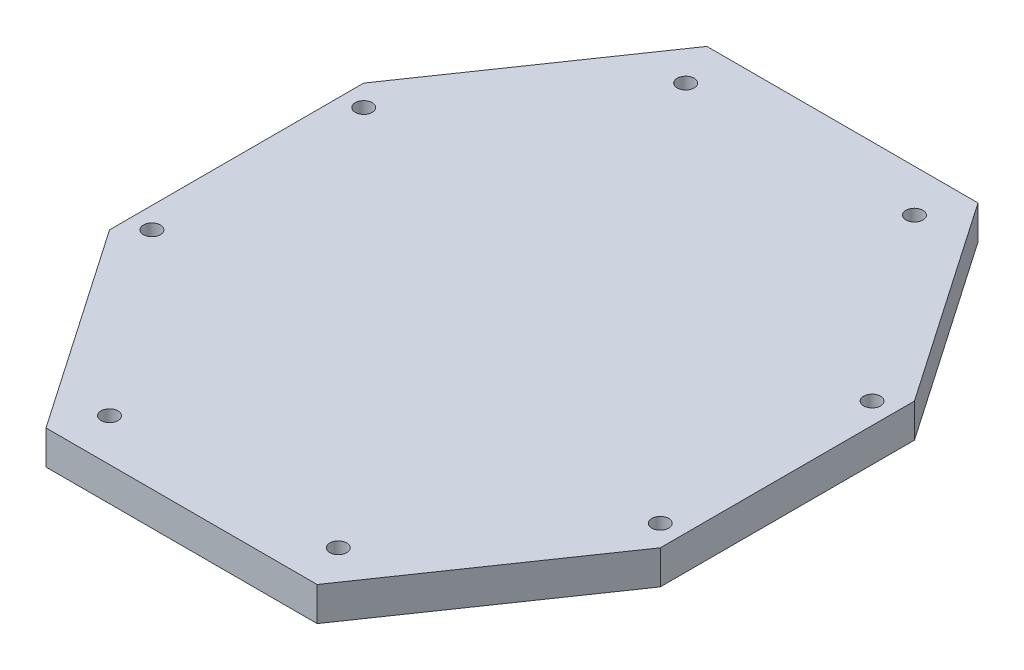
ISO-10303-21;
HEADER;
FILE_DESCRIPTION(('STEP AP214'),'2;1');
FILE_NAME('part.step','',(''),(''),'','','');
FILE_SCHEMA(('AUTOMOTIVE_DESIGN { 1 0 10303 214 1 1 1 1 }'));
ENDSEC;
DATA;
#1=APPLICATION_CONTEXT('core data for automotive mechanical design processes');
#2=APPLICATION_PROTOCOL_DEFINITION('international standard','automotive_design',2000,#1);
#3=PRODUCT_CONTEXT('',#1,'mechanical');
#4=PRODUCT('Part','Part','',(#3));
#5=PRODUCT_RELATED_PRODUCT_CATEGORY('part','',(#4));
#6=PRODUCT_DEFINITION_FORMATION('','',#4);
#7=PRODUCT_DEFINITION_CONTEXT('part definition',#1,'design');
#8=PRODUCT_DEFINITION('design','',#6,#7);
#9=PRODUCT_DEFINITION_SHAPE('','',#8);
#10=(LENGTH_UNIT() NAMED_UNIT(*) SI_UNIT(.MILLI.,.METRE.));
#11=(NAMED_UNIT(*) PLANE_ANGLE_UNIT() SI_UNIT($,.RADIAN.));
#12=(NAMED_UNIT(*) SI_UNIT($,.STERADIAN.) SOLID_ANGLE_UNIT());
#13=UNCERTAINTY_MEASURE_WITH_UNIT(LENGTH_MEASURE(1.E-05),#10,'distance_accuracy_value','');
#14=(GEOMETRIC_REPRESENTATION_CONTEXT(3) GLOBAL_UNCERTAINTY_ASSIGNED_CONTEXT((#13)) GLOBAL_UNIT_ASSIGNED_CONTEXT((#10,
#11,#12)) REPRESENTATION_CONTEXT('',''));
#15=CARTESIAN_POINT('',(0.,0.,0.));
#16=DIRECTION('',(0.,0.,1.));
#17=DIRECTION('',(1.,0.,0.));
#18=AXIS2_PLACEMENT_3D('',#15,#16,#17);
#19=CARTESIAN_POINT('',(0.,8.,0.));
#20=DIRECTION('',(0.,-1.,0.));
#21=DIRECTION('',(0.,0.,-1.));
#22=AXIS2_PLACEMENT_3D('',#19,#20,#21);
#23=PLANE('',#22);
#24=DIRECTION('',(-1.,0.,0.));
#25=VECTOR('',#24,1.);
#26=CARTESIAN_POINT('',(-32.,8.,-53.));
#27=LINE('',#26,#25);
#28=CARTESIAN_POINT('',(32.,8.,-53.));
#29=VERTEX_POINT('',#28);
#30=CARTESIAN_POINT('',(-32.,8.,-53.));
#31=VERTEX_POINT('',#30);
#32=EDGE_CURVE('E164',#29,#31,#27,.T.);
#33=ORIENTED_EDGE('',*,*,#32,.T.);
#34=DIRECTION('',(-0.566528822887065,0.,0.824041924199368));
#35=VECTOR('',#34,1.);
#36=CARTESIAN_POINT('',(-32.,8.,-53.));
#37=LINE('',#36,#35);
#38=CARTESIAN_POINT('',(-65.,8.,-4.99999999999998));
#39=VERTEX_POINT('',#38);
#40=EDGE_CURVE('E100',#31,#39,#37,.T.);
#41=ORIENTED_EDGE('',*,*,#40,.T.);
#42=DIRECTION('',(0.,0.,1.));
#43=VECTOR('',#42,1.);
#44=CARTESIAN_POINT('',(-65.,8.,-4.99999999999998));
#45=LINE('',#44,#43);
#46=CARTESIAN_POINT('',(-65.,8.,55.));
#47=VERTEX_POINT('',#46);
#48=EDGE_CURVE('E185',#39,#47,#45,.T.);
#49=ORIENTED_EDGE('',*,*,#48,.T.);
#50=DIRECTION('',(0.566528822887065,0.,0.824041924199368));
#51=VECTOR('',#50,1.);
#52=CARTESIAN_POINT('',(-32.,8.,103.));
#53=LINE('',#52,#51);
#54=CARTESIAN_POINT('',(-32.,8.,103.));
#55=VERTEX_POINT('',#54);
#56=EDGE_CURVE('E199',#47,#55,#53,.T.);
#57=ORIENTED_EDGE('',*,*,#56,.T.);
#58=DIRECTION('',(1.,0.,0.));
#59=VECTOR('',#58,1.);
#60=CARTESIAN_POINT('',(-32.,8.,103.));
#61=LINE('',#60,#59);
#62=CARTESIAN_POINT('',(32.,8.,103.));
#63=VERTEX_POINT('',#62);
#64=EDGE_CURVE('E119',#55,#63,#61,.T.);
#65=ORIENTED_EDGE('',*,*,#64,.T.);
#66=DIRECTION('',(0.566528822887065,0.,-0.824041924199368));
#67=VECTOR('',#66,1.);
#68=CARTESIAN_POINT('',(32.,8.,103.));
#69=LINE('',#68,#67);
#70=CARTESIAN_POINT('',(65.,8.,55.));
#71=VERTEX_POINT('',#70);
#72=EDGE_CURVE('E113',#63,#71,#69,.T.);
#73=ORIENTED_EDGE('',*,*,#72,.T.);
#74=DIRECTION('',(0.,0.,-1.));
#75=VECTOR('',#74,1.);
#76=CARTESIAN_POINT('',(65.,8.,-5.));
#77=LINE('',#76,#75);
#78=CARTESIAN_POINT('',(65.,8.,-5.));
#79=VERTEX_POINT('',#78);
#80=EDGE_CURVE('E117',#71,#79,#77,.T.);
#81=ORIENTED_EDGE('',*,*,#80,.T.);
#82=DIRECTION('',(-0.566528822887065,0.,-0.824041924199368));
#83=VECTOR('',#82,1.);
#84=CARTESIAN_POINT('',(32.,8.,-53.));
#85=LINE('',#84,#83);
#86=EDGE_CURVE('E57',#79,#29,#85,.T.);
#87=ORIENTED_EDGE('',*,*,#86,.T.);
#88=EDGE_LOOP('',(#33,#41,#49,#57,#65,#73,#81,#87));
#89=FACE_BOUND('',#88,.T.);
#90=CARTESIAN_POINT('',(27.,8.,93.));
#91=DIRECTION('',(0.,1.,0.));
#92=DIRECTION('',(0.,0.,1.));
#93=AXIS2_PLACEMENT_3D('',#90,#91,#92);
#94=CIRCLE('',#93,2.);
#95=CARTESIAN_POINT('',(27.,8.,95.));
#96=VERTEX_POINT('',#95);
#97=EDGE_CURVE('E146',#96,#96,#94,.T.);
#98=ORIENTED_EDGE('',*,*,#97,.F.);
#99=EDGE_LOOP('',(#98));
#100=FACE_BOUND('',#99,.T.);
#101=CARTESIAN_POINT('',(27.,8.,-43.));
#102=DIRECTION('',(0.,1.,0.));
#103=DIRECTION('',(0.,0.,1.));
#104=AXIS2_PLACEMENT_3D('',#101,#102,#103);
#105=CIRCLE('',#104,2.);
#106=CARTESIAN_POINT('',(27.,8.,-41.));
#107=VERTEX_POINT('',#106);
#108=EDGE_CURVE('E213',#107,#107,#105,.T.);
#109=ORIENTED_EDGE('',*,*,#108,.F.);
#110=EDGE_LOOP('',(#109));
#111=FACE_BOUND('',#110,.T.);
#112=CARTESIAN_POINT('',(60.,8.,0.));
#113=DIRECTION('',(0.,1.,0.));
#114=DIRECTION('',(0.,0.,1.));
#115=AXIS2_PLACEMENT_3D('',#112,#113,#114);
#116=CIRCLE('',#115,2.);
#117=CARTESIAN_POINT('',(60.,8.,2.));
#118=VERTEX_POINT('',#117);
#119=EDGE_CURVE('E221',#118,#118,#116,.T.);
#120=ORIENTED_EDGE('',*,*,#119,.F.);
#121=EDGE_LOOP('',(#120));
#122=FACE_BOUND('',#121,.T.);
#123=CARTESIAN_POINT('',(60.,8.,50.));
#124=DIRECTION('',(0.,1.,0.));
#125=DIRECTION('',(0.,0.,1.));
#126=AXIS2_PLACEMENT_3D('',#123,#124,#125);
#127=CIRCLE('',#126,2.);
#128=CARTESIAN_POINT('',(60.,8.,52.));
#129=VERTEX_POINT('',#128);
#130=EDGE_CURVE('E229',#129,#129,#127,.T.);
#131=ORIENTED_EDGE('',*,*,#130,.F.);
#132=EDGE_LOOP('',(#131));
#133=FACE_BOUND('',#132,.T.);
#134=CARTESIAN_POINT('',(-27.,8.,93.));
#135=DIRECTION('',(0.,1.,0.));
#136=DIRECTION('',(0.,0.,-1.));
#137=AXIS2_PLACEMENT_3D('',#134,#135,#136);
#138=CIRCLE('',#137,2.);
#139=CARTESIAN_POINT('',(-27.,8.,91.));
#140=VERTEX_POINT('',#139);
#141=EDGE_CURVE('E237',#140,#140,#138,.T.);
#142=ORIENTED_EDGE('',*,*,#141,.F.);
#143=EDGE_LOOP('',(#142));
#144=FACE_BOUND('',#143,.T.);
#145=CARTESIAN_POINT('',(-60.,8.,50.));
#146=DIRECTION('',(0.,1.,0.));
#147=DIRECTION('',(0.,0.,-1.));
#148=AXIS2_PLACEMENT_3D('',#145,#146,#147);
#149=CIRCLE('',#148,2.);
#150=CARTESIAN_POINT('',(-60.,8.,48.));
#151=VERTEX_POINT('',#150);
#152=EDGE_CURVE('E245',#151,#151,#149,.T.);
#153=ORIENTED_EDGE('',*,*,#152,.F.);
#154=EDGE_LOOP('',(#153));
#155=FACE_BOUND('',#154,.T.);
#156=CARTESIAN_POINT('',(-60.,8.,0.));
#157=DIRECTION('',(0.,1.,0.));
#158=DIRECTION('',(0.,0.,-1.));
#159=AXIS2_PLACEMENT_3D('',#156,#157,#158);
#160=CIRCLE('',#159,2.);
#161=CARTESIAN_POINT('',(-60.,8.,-2.));
#162=VERTEX_POINT('',#161);
#163=EDGE_CURVE('E253',#162,#162,#160,.T.);
#164=ORIENTED_EDGE('',*,*,#163,.F.);
#165=EDGE_LOOP('',(#164));
#166=FACE_BOUND('',#165,.T.);
#167=CARTESIAN_POINT('',(-27.,8.,-43.));
#168=DIRECTION('',(0.,1.,0.));
#169=DIRECTION('',(0.,0.,-1.));
#170=AXIS2_PLACEMENT_3D('',#167,#168,#169);
#171=CIRCLE('',#170,2.);
#172=CARTESIAN_POINT('',(-27.,8.,-45.));
#173=VERTEX_POINT('',#172);
#174=EDGE_CURVE('E261',#173,#173,#171,.T.);
#175=ORIENTED_EDGE('',*,*,#174,.F.);
#176=EDGE_LOOP('',(#175));
#177=FACE_BOUND('',#176,.T.);
#178=ADVANCED_FACE('F39',(#89,#100,#111,#122,#133,#144,#155,#166,#177),#23,.F.);
#179=CARTESIAN_POINT('',(0.,0.,0.));
#180=DIRECTION('',(0.,-1.,0.));
#181=DIRECTION('',(0.,0.,-1.));
#182=AXIS2_PLACEMENT_3D('',#179,#180,#181);
#183=PLANE('',#182);
#184=CARTESIAN_POINT('',(-60.,0.,0.));
#185=DIRECTION('',(0.,1.,0.));
#186=DIRECTION('',(0.,0.,-1.));
#187=AXIS2_PLACEMENT_3D('',#184,#185,#186);
#188=CIRCLE('',#187,2.);
#189=CARTESIAN_POINT('',(-60.,0.,-2.));
#190=VERTEX_POINT('',#189);
#191=EDGE_CURVE('E257',#190,#190,#188,.T.);
#192=ORIENTED_EDGE('',*,*,#191,.T.);
#193=EDGE_LOOP('',(#192));
#194=FACE_BOUND('',#193,.T.);
#195=CARTESIAN_POINT('',(-27.,0.,93.));
#196=DIRECTION('',(0.,1.,0.));
#197=DIRECTION('',(0.,0.,-1.));
#198=AXIS2_PLACEMENT_3D('',#195,#196,#197);
#199=CIRCLE('',#198,2.);
#200=CARTESIAN_POINT('',(-27.,0.,91.));
#201=VERTEX_POINT('',#200);
#202=EDGE_CURVE('E241',#201,#201,#199,.T.);
#203=ORIENTED_EDGE('',*,*,#202,.T.);
#204=EDGE_LOOP('',(#203));
#205=FACE_BOUND('',#204,.T.);
#206=CARTESIAN_POINT('',(60.,0.,0.));
#207=DIRECTION('',(0.,1.,0.));
#208=DIRECTION('',(0.,0.,1.));
#209=AXIS2_PLACEMENT_3D('',#206,#207,#208);
#210=CIRCLE('',#209,2.);
#211=CARTESIAN_POINT('',(60.,0.,2.));
#212=VERTEX_POINT('',#211);
#213=EDGE_CURVE('E225',#212,#212,#210,.T.);
#214=ORIENTED_EDGE('',*,*,#213,.T.);
#215=EDGE_LOOP('',(#214));
#216=FACE_BOUND('',#215,.T.);
#217=CARTESIAN_POINT('',(27.,0.,93.));
#218=DIRECTION('',(0.,1.,0.));
#219=DIRECTION('',(0.,0.,1.));
#220=AXIS2_PLACEMENT_3D('',#217,#218,#219);
#221=CIRCLE('',#220,2.);
#222=CARTESIAN_POINT('',(27.,0.,95.));
#223=VERTEX_POINT('',#222);
#224=EDGE_CURVE('E209',#223,#223,#221,.T.);
#225=ORIENTED_EDGE('',*,*,#224,.T.);
#226=EDGE_LOOP('',(#225));
#227=FACE_BOUND('',#226,.T.);
#228=DIRECTION('',(-1.,0.,0.));
#229=VECTOR('',#228,1.);
#230=CARTESIAN_POINT('',(-32.,0.,-53.));
#231=LINE('',#230,#229);
#232=CARTESIAN_POINT('',(32.,0.,-53.));
#233=VERTEX_POINT('',#232);
#234=CARTESIAN_POINT('',(-32.,0.,-53.));
#235=VERTEX_POINT('',#234);
#236=EDGE_CURVE('E141',#233,#235,#231,.T.);
#237=ORIENTED_EDGE('',*,*,#236,.F.);
#238=DIRECTION('',(-0.566528822887065,0.,-0.824041924199368));
#239=VECTOR('',#238,1.);
#240=CARTESIAN_POINT('',(32.,0.,-53.));
#241=LINE('',#240,#239);
#242=CARTESIAN_POINT('',(65.,0.,-5.));
#243=VERTEX_POINT('',#242);
#244=EDGE_CURVE('E92',#243,#233,#241,.T.);
#245=ORIENTED_EDGE('',*,*,#244,.F.);
#246=DIRECTION('',(0.,0.,-1.));
#247=VECTOR('',#246,1.);
#248=CARTESIAN_POINT('',(65.,0.,-5.));
#249=LINE('',#248,#247);
#250=CARTESIAN_POINT('',(65.,0.,55.));
#251=VERTEX_POINT('',#250);
#252=EDGE_CURVE('E86',#251,#243,#249,.T.);
#253=ORIENTED_EDGE('',*,*,#252,.F.);
#254=DIRECTION('',(0.566528822887065,0.,-0.824041924199368));
#255=VECTOR('',#254,1.);
#256=CARTESIAN_POINT('',(32.,0.,103.));
#257=LINE('',#256,#255);
#258=CARTESIAN_POINT('',(32.,0.,103.));
#259=VERTEX_POINT('',#258);
#260=EDGE_CURVE('E128',#259,#251,#257,.T.);
#261=ORIENTED_EDGE('',*,*,#260,.F.);
#262=DIRECTION('',(1.,0.,0.));
#263=VECTOR('',#262,1.);
#264=CARTESIAN_POINT('',(-32.,0.,103.));
#265=LINE('',#264,#263);
#266=CARTESIAN_POINT('',(-32.,0.,103.));
#267=VERTEX_POINT('',#266);
#268=EDGE_CURVE('E155',#267,#259,#265,.T.);
#269=ORIENTED_EDGE('',*,*,#268,.F.);
#270=DIRECTION('',(0.566528822887065,0.,0.824041924199368));
#271=VECTOR('',#270,1.);
#272=CARTESIAN_POINT('',(-32.,0.,103.));
#273=LINE('',#272,#271);
#274=CARTESIAN_POINT('',(-65.,0.,55.));
#275=VERTEX_POINT('',#274);
#276=EDGE_CURVE('E152',#275,#267,#273,.T.);
#277=ORIENTED_EDGE('',*,*,#276,.F.);
#278=DIRECTION('',(0.,0.,1.));
#279=VECTOR('',#278,1.);
#280=CARTESIAN_POINT('',(-65.,0.,-4.99999999999998));
#281=LINE('',#280,#279);
#282=CARTESIAN_POINT('',(-65.,0.,-4.99999999999998));
#283=VERTEX_POINT('',#282);
#284=EDGE_CURVE('E149',#283,#275,#281,.T.);
#285=ORIENTED_EDGE('',*,*,#284,.F.);
#286=DIRECTION('',(-0.566528822887065,0.,0.824041924199368));
#287=VECTOR('',#286,1.);
#288=CARTESIAN_POINT('',(-32.,0.,-53.));
#289=LINE('',#288,#287);
#290=EDGE_CURVE('E145',#235,#283,#289,.T.);
#291=ORIENTED_EDGE('',*,*,#290,.F.);
#292=EDGE_LOOP('',(#237,#245,#253,#261,#269,#277,#285,#291));
#293=FACE_BOUND('',#292,.T.);
#294=CARTESIAN_POINT('',(27.,0.,-43.));
#295=DIRECTION('',(0.,1.,0.));
#296=DIRECTION('',(0.,0.,1.));
#297=AXIS2_PLACEMENT_3D('',#294,#295,#296);
#298=CIRCLE('',#297,2.);
#299=CARTESIAN_POINT('',(27.,0.,-41.));
#300=VERTEX_POINT('',#299);
#301=EDGE_CURVE('E217',#300,#300,#298,.T.);
#302=ORIENTED_EDGE('',*,*,#301,.T.);
#303=EDGE_LOOP('',(#302));
#304=FACE_BOUND('',#303,.T.);
#305=CARTESIAN_POINT('',(60.,0.,50.));
#306=DIRECTION('',(0.,1.,0.));
#307=DIRECTION('',(0.,0.,1.));
#308=AXIS2_PLACEMENT_3D('',#305,#306,#307);
#309=CIRCLE('',#308,2.);
#310=CARTESIAN_POINT('',(60.,0.,52.));
#311=VERTEX_POINT('',#310);
#312=EDGE_CURVE('E233',#311,#311,#309,.T.);
#313=ORIENTED_EDGE('',*,*,#312,.T.);
#314=EDGE_LOOP('',(#313));
#315=FACE_BOUND('',#314,.T.);
#316=CARTESIAN_POINT('',(-60.,0.,50.));
#317=DIRECTION('',(0.,1.,0.));
#318=DIRECTION('',(0.,0.,-1.));
#319=AXIS2_PLACEMENT_3D('',#316,#317,#318);
#320=CIRCLE('',#319,2.);
#321=CARTESIAN_POINT('',(-60.,0.,48.));
#322=VERTEX_POINT('',#321);
#323=EDGE_CURVE('E249',#322,#322,#320,.T.);
#324=ORIENTED_EDGE('',*,*,#323,.T.);
#325=EDGE_LOOP('',(#324));
#326=FACE_BOUND('',#325,.T.);
#327=CARTESIAN_POINT('',(-27.,0.,-43.));
#328=DIRECTION('',(0.,1.,0.));
#329=DIRECTION('',(0.,0.,-1.));
#330=AXIS2_PLACEMENT_3D('',#327,#328,#329);
#331=CIRCLE('',#330,2.);
#332=CARTESIAN_POINT('',(-27.,0.,-45.));
#333=VERTEX_POINT('',#332);
#334=EDGE_CURVE('E265',#333,#333,#331,.T.);
#335=ORIENTED_EDGE('',*,*,#334,.T.);
#336=EDGE_LOOP('',(#335));
#337=FACE_BOUND('',#336,.T.);
#338=ADVANCED_FACE('F189',(#194,#205,#216,#227,#293,#304,#315,#326,#337),#183,.T.);
#339=CARTESIAN_POINT('',(-32.,8.,-53.));
#340=DIRECTION('',(0.,0.,1.));
#341=DIRECTION('',(1.,0.,0.));
#342=AXIS2_PLACEMENT_3D('',#339,#340,#341);
#343=PLANE('',#342);
#344=ORIENTED_EDGE('',*,*,#236,.T.);
#345=DIRECTION('',(0.,-1.,0.));
#346=VECTOR('',#345,1.);
#347=CARTESIAN_POINT('',(-32.,8.,-53.));
#348=LINE('',#347,#346);
#349=EDGE_CURVE('E11',#31,#235,#348,.T.);
#350=ORIENTED_EDGE('',*,*,#349,.F.);
#351=ORIENTED_EDGE('',*,*,#32,.F.);
#352=DIRECTION('',(0.,-1.,0.));
#353=VECTOR('',#352,1.);
#354=CARTESIAN_POINT('',(32.,8.,-53.));
#355=LINE('',#354,#353);
#356=EDGE_CURVE('E137',#29,#233,#355,.T.);
#357=ORIENTED_EDGE('',*,*,#356,.T.);
#358=EDGE_LOOP('',(#344,#350,#351,#357));
#359=FACE_BOUND('',#358,.T.);
#360=ADVANCED_FACE('F41',(#359),#343,.F.);
#361=CARTESIAN_POINT('',(-32.,8.,-53.));
#362=DIRECTION('',(0.824041924199368,0.,0.566528822887065));
#363=DIRECTION('',(0.566528822887065,0.,-0.824041924199368));
#364=AXIS2_PLACEMENT_3D('',#361,#362,#363);
#365=PLANE('',#364);
#366=ORIENTED_EDGE('',*,*,#290,.T.);
#367=DIRECTION('',(0.,-1.,0.));
#368=VECTOR('',#367,1.);
#369=CARTESIAN_POINT('',(-65.,8.,-4.99999999999998));
#370=LINE('',#369,#368);
#371=EDGE_CURVE('E49',#39,#283,#370,.T.);
#372=ORIENTED_EDGE('',*,*,#371,.F.);
#373=ORIENTED_EDGE('',*,*,#40,.F.);
#374=ORIENTED_EDGE('',*,*,#349,.T.);
#375=EDGE_LOOP('',(#366,#372,#373,#374));
#376=FACE_BOUND('',#375,.T.);
#377=ADVANCED_FACE('F299',(#376),#365,.F.);
#378=CARTESIAN_POINT('',(-65.,8.,-4.99999999999998));
#379=DIRECTION('',(1.,0.,0.));
#380=DIRECTION('',(0.,0.,-1.));
#381=AXIS2_PLACEMENT_3D('',#378,#379,#380);
#382=PLANE('',#381);
#383=ORIENTED_EDGE('',*,*,#284,.T.);
#384=DIRECTION('',(0.,-1.,0.));
#385=VECTOR('',#384,1.);
#386=CARTESIAN_POINT('',(-65.,8.,55.));
#387=LINE('',#386,#385);
#388=EDGE_CURVE('E175',#47,#275,#387,.T.);
#389=ORIENTED_EDGE('',*,*,#388,.F.);
#390=ORIENTED_EDGE('',*,*,#48,.F.);
#391=ORIENTED_EDGE('',*,*,#371,.T.);
#392=EDGE_LOOP('',(#383,#389,#390,#391));
#393=FACE_BOUND('',#392,.T.);
#394=ADVANCED_FACE('F183',(#393),#382,.F.);
#395=CARTESIAN_POINT('',(-32.,8.,103.));
#396=DIRECTION('',(0.824041924199368,0.,-0.566528822887065));
#397=DIRECTION('',(-0.566528822887065,0.,-0.824041924199368));
#398=AXIS2_PLACEMENT_3D('',#395,#396,#397);
#399=PLANE('',#398);
#400=ORIENTED_EDGE('',*,*,#276,.T.);
#401=DIRECTION('',(0.,-1.,0.));
#402=VECTOR('',#401,1.);
#403=CARTESIAN_POINT('',(-32.,8.,103.));
#404=LINE('',#403,#402);
#405=EDGE_CURVE('E171',#55,#267,#404,.T.);
#406=ORIENTED_EDGE('',*,*,#405,.F.);
#407=ORIENTED_EDGE('',*,*,#56,.F.);
#408=ORIENTED_EDGE('',*,*,#388,.T.);
#409=EDGE_LOOP('',(#400,#406,#407,#408));
#410=FACE_BOUND('',#409,.T.);
#411=ADVANCED_FACE('F194',(#410),#399,.F.);
#412=CARTESIAN_POINT('',(-32.,8.,103.));
#413=DIRECTION('',(0.,0.,-1.));
#414=DIRECTION('',(-1.,0.,0.));
#415=AXIS2_PLACEMENT_3D('',#412,#413,#414);
#416=PLANE('',#415);
#417=ORIENTED_EDGE('',*,*,#268,.T.);
#418=DIRECTION('',(0.,-1.,0.));
#419=VECTOR('',#418,1.);
#420=CARTESIAN_POINT('',(32.,8.,103.));
#421=LINE('',#420,#419);
#422=EDGE_CURVE('E130',#63,#259,#421,.T.);
#423=ORIENTED_EDGE('',*,*,#422,.F.);
#424=ORIENTED_EDGE('',*,*,#64,.F.);
#425=ORIENTED_EDGE('',*,*,#405,.T.);
#426=EDGE_LOOP('',(#417,#423,#424,#425));
#427=FACE_BOUND('',#426,.T.);
#428=ADVANCED_FACE('F197',(#427),#416,.F.);
#429=CARTESIAN_POINT('',(32.,8.,103.));
#430=DIRECTION('',(-0.824041924199368,0.,-0.566528822887065));
#431=DIRECTION('',(-0.566528822887065,0.,0.824041924199368));
#432=AXIS2_PLACEMENT_3D('',#429,#430,#431);
#433=PLANE('',#432);
#434=ORIENTED_EDGE('',*,*,#260,.T.);
#435=DIRECTION('',(0.,-1.,0.));
#436=VECTOR('',#435,1.);
#437=CARTESIAN_POINT('',(65.,8.,55.));
#438=LINE('',#437,#436);
#439=EDGE_CURVE('E125',#71,#251,#438,.T.);
#440=ORIENTED_EDGE('',*,*,#439,.F.);
#441=ORIENTED_EDGE('',*,*,#72,.F.);
#442=ORIENTED_EDGE('',*,*,#422,.T.);
#443=EDGE_LOOP('',(#434,#440,#441,#442));
#444=FACE_BOUND('',#443,.T.);
#445=ADVANCED_FACE('F126',(#444),#433,.F.);
#446=CARTESIAN_POINT('',(65.,8.,-5.));
#447=DIRECTION('',(-1.,0.,0.));
#448=DIRECTION('',(0.,0.,1.));
#449=AXIS2_PLACEMENT_3D('',#446,#447,#448);
#450=PLANE('',#449);
#451=ORIENTED_EDGE('',*,*,#252,.T.);
#452=DIRECTION('',(0.,-1.,0.));
#453=VECTOR('',#452,1.);
#454=CARTESIAN_POINT('',(65.,8.,-5.));
#455=LINE('',#454,#453);
#456=EDGE_CURVE('E131',#79,#243,#455,.T.);
#457=ORIENTED_EDGE('',*,*,#456,.F.);
#458=ORIENTED_EDGE('',*,*,#80,.F.);
#459=ORIENTED_EDGE('',*,*,#439,.T.);
#460=EDGE_LOOP('',(#451,#457,#458,#459));
#461=FACE_BOUND('',#460,.T.);
#462=ADVANCED_FACE('F133',(#461),#450,.F.);
#463=CARTESIAN_POINT('',(32.,8.,-53.));
#464=DIRECTION('',(-0.824041924199368,0.,0.566528822887065));
#465=DIRECTION('',(0.566528822887065,0.,0.824041924199368));
#466=AXIS2_PLACEMENT_3D('',#463,#464,#465);
#467=PLANE('',#466);
#468=ORIENTED_EDGE('',*,*,#244,.T.);
#469=ORIENTED_EDGE('',*,*,#356,.F.);
#470=ORIENTED_EDGE('',*,*,#86,.F.);
#471=ORIENTED_EDGE('',*,*,#456,.T.);
#472=EDGE_LOOP('',(#468,#469,#470,#471));
#473=FACE_BOUND('',#472,.T.);
#474=ADVANCED_FACE('F287',(#473),#467,.F.);
#475=CARTESIAN_POINT('',(27.,8.,93.));
#476=DIRECTION('',(0.,-1.,0.));
#477=DIRECTION('',(0.,0.,-1.));
#478=AXIS2_PLACEMENT_3D('',#475,#476,#477);
#479=CYLINDRICAL_SURFACE('',#478,2.);
#480=ORIENTED_EDGE('',*,*,#97,.T.);
#481=EDGE_LOOP('',(#480));
#482=FACE_BOUND('',#481,.T.);
#483=ORIENTED_EDGE('',*,*,#224,.F.);
#484=EDGE_LOOP('',(#483));
#485=FACE_BOUND('',#484,.T.);
#486=ADVANCED_FACE('F284',(#482,#485),#479,.F.);
#487=CARTESIAN_POINT('',(27.,8.,-43.));
#488=DIRECTION('',(0.,-1.,0.));
#489=DIRECTION('',(0.,0.,-1.));
#490=AXIS2_PLACEMENT_3D('',#487,#488,#489);
#491=CYLINDRICAL_SURFACE('',#490,2.);
#492=ORIENTED_EDGE('',*,*,#108,.T.);
#493=EDGE_LOOP('',(#492));
#494=FACE_BOUND('',#493,.T.);
#495=ORIENTED_EDGE('',*,*,#301,.F.);
#496=EDGE_LOOP('',(#495));
#497=FACE_BOUND('',#496,.T.);
#498=ADVANCED_FACE('F363',(#494,#497),#491,.F.);
#499=CARTESIAN_POINT('',(60.,8.,0.));
#500=DIRECTION('',(0.,-1.,0.));
#501=DIRECTION('',(0.,0.,-1.));
#502=AXIS2_PLACEMENT_3D('',#499,#500,#501);
#503=CYLINDRICAL_SURFACE('',#502,2.);
#504=ORIENTED_EDGE('',*,*,#119,.T.);
#505=EDGE_LOOP('',(#504));
#506=FACE_BOUND('',#505,.T.);
#507=ORIENTED_EDGE('',*,*,#213,.F.);
#508=EDGE_LOOP('',(#507));
#509=FACE_BOUND('',#508,.T.);
#510=ADVANCED_FACE('F371',(#506,#509),#503,.F.);
#511=CARTESIAN_POINT('',(60.,8.,50.));
#512=DIRECTION('',(0.,-1.,0.));
#513=DIRECTION('',(0.,0.,-1.));
#514=AXIS2_PLACEMENT_3D('',#511,#512,#513);
#515=CYLINDRICAL_SURFACE('',#514,2.);
#516=ORIENTED_EDGE('',*,*,#130,.T.);
#517=EDGE_LOOP('',(#516));
#518=FACE_BOUND('',#517,.T.);
#519=ORIENTED_EDGE('',*,*,#312,.F.);
#520=EDGE_LOOP('',(#519));
#521=FACE_BOUND('',#520,.T.);
#522=ADVANCED_FACE('F379',(#518,#521),#515,.F.);
#523=CARTESIAN_POINT('',(-27.,8.,93.));
#524=DIRECTION('',(0.,-1.,0.));
#525=DIRECTION('',(0.,0.,-1.));
#526=AXIS2_PLACEMENT_3D('',#523,#524,#525);
#527=CYLINDRICAL_SURFACE('',#526,2.);
#528=ORIENTED_EDGE('',*,*,#141,.T.);
#529=EDGE_LOOP('',(#528));
#530=FACE_BOUND('',#529,.T.);
#531=ORIENTED_EDGE('',*,*,#202,.F.);
#532=EDGE_LOOP('',(#531));
#533=FACE_BOUND('',#532,.T.);
#534=ADVANCED_FACE('F388',(#530,#533),#527,.F.);
#535=CARTESIAN_POINT('',(-60.,8.,50.));
#536=DIRECTION('',(0.,-1.,0.));
#537=DIRECTION('',(0.,0.,-1.));
#538=AXIS2_PLACEMENT_3D('',#535,#536,#537);
#539=CYLINDRICAL_SURFACE('',#538,2.);
#540=ORIENTED_EDGE('',*,*,#152,.T.);
#541=EDGE_LOOP('',(#540));
#542=FACE_BOUND('',#541,.T.);
#543=ORIENTED_EDGE('',*,*,#323,.F.);
#544=EDGE_LOOP('',(#543));
#545=FACE_BOUND('',#544,.T.);
#546=ADVANCED_FACE('F397',(#542,#545),#539,.F.);
#547=CARTESIAN_POINT('',(-60.,8.,0.));
#548=DIRECTION('',(0.,-1.,0.));
#549=DIRECTION('',(0.,0.,-1.));
#550=AXIS2_PLACEMENT_3D('',#547,#548,#549);
#551=CYLINDRICAL_SURFACE('',#550,2.);
#552=ORIENTED_EDGE('',*,*,#163,.T.);
#553=EDGE_LOOP('',(#552));
#554=FACE_BOUND('',#553,.T.);
#555=ORIENTED_EDGE('',*,*,#191,.F.);
#556=EDGE_LOOP('',(#555));
#557=FACE_BOUND('',#556,.T.);
#558=ADVANCED_FACE('F406',(#554,#557),#551,.F.);
#559=CARTESIAN_POINT('',(-27.,8.,-43.));
#560=DIRECTION('',(0.,-1.,0.));
#561=DIRECTION('',(0.,0.,-1.));
#562=AXIS2_PLACEMENT_3D('',#559,#560,#561);
#563=CYLINDRICAL_SURFACE('',#562,2.);
#564=ORIENTED_EDGE('',*,*,#174,.T.);
#565=EDGE_LOOP('',(#564));
#566=FACE_BOUND('',#565,.T.);
#567=ORIENTED_EDGE('',*,*,#334,.F.);
#568=EDGE_LOOP('',(#567));
#569=FACE_BOUND('',#568,.T.);
#570=ADVANCED_FACE('F273',(#566,#569),#563,.F.);
#571=CLOSED_SHELL('',(#178,#338,#360,#377,#394,#411,#428,#445,#462,#474,#486,#498,#510,#522,
#534,#546,#558,#570));
#572=MANIFOLD_SOLID_BREP('B2',#571);
#573=ADVANCED_BREP_SHAPE_REPRESENTATION('',(#18,#572),#14);
#574=SHAPE_DEFINITION_REPRESENTATION(#9,#573);
ENDSEC;
END-ISO-10303-21;
